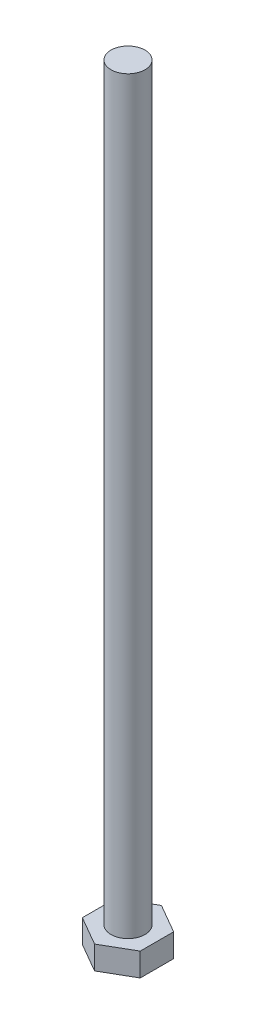
ISO-10303-21;
HEADER;
FILE_DESCRIPTION(('STEP AP214'),'2;1');
FILE_NAME('part.step','',(''),(''),'','','');
FILE_SCHEMA(('AUTOMOTIVE_DESIGN { 1 0 10303 214 1 1 1 1 }'));
ENDSEC;
DATA;
#1=APPLICATION_CONTEXT('core data for automotive mechanical design processes');
#2=APPLICATION_PROTOCOL_DEFINITION('international standard','automotive_design',2000,#1);
#3=PRODUCT_CONTEXT('',#1,'mechanical');
#4=PRODUCT('Part','Part','',(#3));
#5=PRODUCT_RELATED_PRODUCT_CATEGORY('part','',(#4));
#6=PRODUCT_DEFINITION_FORMATION('','',#4);
#7=PRODUCT_DEFINITION_CONTEXT('part definition',#1,'design');
#8=PRODUCT_DEFINITION('design','',#6,#7);
#9=PRODUCT_DEFINITION_SHAPE('','',#8);
#10=(LENGTH_UNIT() NAMED_UNIT(*) SI_UNIT(.MILLI.,.METRE.));
#11=(NAMED_UNIT(*) PLANE_ANGLE_UNIT() SI_UNIT($,.RADIAN.));
#12=(NAMED_UNIT(*) SI_UNIT($,.STERADIAN.) SOLID_ANGLE_UNIT());
#13=UNCERTAINTY_MEASURE_WITH_UNIT(LENGTH_MEASURE(1.E-05),#10,'distance_accuracy_value','');
#14=(GEOMETRIC_REPRESENTATION_CONTEXT(3) GLOBAL_UNCERTAINTY_ASSIGNED_CONTEXT((#13)) GLOBAL_UNIT_ASSIGNED_CONTEXT((#10,
#11,#12)) REPRESENTATION_CONTEXT('',''));
#15=CARTESIAN_POINT('',(0.,0.,0.));
#16=DIRECTION('',(0.,0.,1.));
#17=DIRECTION('',(1.,0.,0.));
#18=AXIS2_PLACEMENT_3D('',#15,#16,#17);
#19=CARTESIAN_POINT('',(0.,8.,0.));
#20=DIRECTION('',(0.,1.,0.));
#21=DIRECTION('',(0.,0.,1.));
#22=AXIS2_PLACEMENT_3D('',#19,#20,#21);
#23=PLANE('',#22);
#24=DIRECTION('',(0.866025403784439,0.,-0.5));
#25=VECTOR('',#24,1.);
#26=CARTESIAN_POINT('',(0.,8.,9.81495457622364));
#27=LINE('',#26,#25);
#28=CARTESIAN_POINT('',(0.,8.,9.81495457622364));
#29=VERTEX_POINT('',#28);
#30=CARTESIAN_POINT('',(8.5,8.,4.90747728811182));
#31=VERTEX_POINT('',#30);
#32=EDGE_CURVE('E118',#29,#31,#27,.T.);
#33=ORIENTED_EDGE('',*,*,#32,.T.);
#34=DIRECTION('',(0.,0.,-1.));
#35=VECTOR('',#34,1.);
#36=CARTESIAN_POINT('',(8.5,8.,4.90747728811182));
#37=LINE('',#36,#35);
#38=CARTESIAN_POINT('',(8.5,8.,-4.90747728811182));
#39=VERTEX_POINT('',#38);
#40=EDGE_CURVE('E107',#31,#39,#37,.T.);
#41=ORIENTED_EDGE('',*,*,#40,.T.);
#42=DIRECTION('',(-0.866025403784439,0.,-0.5));
#43=VECTOR('',#42,1.);
#44=CARTESIAN_POINT('',(8.5,8.,-4.90747728811182));
#45=LINE('',#44,#43);
#46=CARTESIAN_POINT('',(0.,8.,-9.81495457622364));
#47=VERTEX_POINT('',#46);
#48=EDGE_CURVE('E117',#39,#47,#45,.T.);
#49=ORIENTED_EDGE('',*,*,#48,.T.);
#50=DIRECTION('',(-0.866025403784439,0.,0.5));
#51=VECTOR('',#50,1.);
#52=CARTESIAN_POINT('',(0.,8.,-9.81495457622364));
#53=LINE('',#52,#51);
#54=CARTESIAN_POINT('',(-8.5,8.,-4.90747728811182));
#55=VERTEX_POINT('',#54);
#56=EDGE_CURVE('E186',#47,#55,#53,.T.);
#57=ORIENTED_EDGE('',*,*,#56,.T.);
#58=DIRECTION('',(0.,0.,1.));
#59=VECTOR('',#58,1.);
#60=CARTESIAN_POINT('',(-8.5,8.,-4.90747728811182));
#61=LINE('',#60,#59);
#62=CARTESIAN_POINT('',(-8.5,8.,4.90747728811182));
#63=VERTEX_POINT('',#62);
#64=EDGE_CURVE('E188',#55,#63,#61,.T.);
#65=ORIENTED_EDGE('',*,*,#64,.T.);
#66=DIRECTION('',(0.866025403784438,0.,0.5));
#67=VECTOR('',#66,1.);
#68=CARTESIAN_POINT('',(-8.5,8.,4.90747728811182));
#69=LINE('',#68,#67);
#70=EDGE_CURVE('E123',#63,#29,#69,.T.);
#71=ORIENTED_EDGE('',*,*,#70,.T.);
#72=EDGE_LOOP('',(#33,#41,#49,#57,#65,#71));
#73=FACE_BOUND('',#72,.T.);
#74=CARTESIAN_POINT('',(0.,8.,0.));
#75=DIRECTION('',(0.,1.,0.));
#76=DIRECTION('',(0.,0.,1.));
#77=AXIS2_PLACEMENT_3D('',#74,#75,#76);
#78=CIRCLE('',#77,5.);
#79=CARTESIAN_POINT('',(0.,8.,5.));
#80=VERTEX_POINT('',#79);
#81=EDGE_CURVE('E174',#80,#80,#78,.T.);
#82=ORIENTED_EDGE('',*,*,#81,.F.);
#83=EDGE_LOOP('',(#82));
#84=FACE_BOUND('',#83,.T.);
#85=ADVANCED_FACE('F34',(#73,#84),#23,.T.);
#86=CARTESIAN_POINT('',(0.,8.,9.81495457622364));
#87=DIRECTION('',(-0.5,0.,-0.866025403784439));
#88=DIRECTION('',(-0.866025403784439,0.,0.5));
#89=AXIS2_PLACEMENT_3D('',#86,#87,#88);
#90=PLANE('',#89);
#91=DIRECTION('',(0.,-1.,0.));
#92=VECTOR('',#91,1.);
#93=CARTESIAN_POINT('',(0.,8.,9.81495457622364));
#94=LINE('',#93,#92);
#95=CARTESIAN_POINT('',(0.,1.15470053837927,9.81495457622364));
#96=VERTEX_POINT('',#95);
#97=EDGE_CURVE('E191',#29,#96,#94,.T.);
#98=ORIENTED_EDGE('',*,*,#97,.T.);
#99=DIRECTION('',(0.866025403784439,0.,-0.5));
#100=VECTOR('',#99,1.);
#101=CARTESIAN_POINT('',(0.,1.15470053837927,9.81495457622364));
#102=LINE('',#101,#100);
#103=CARTESIAN_POINT('',(8.5,1.15470053837927,4.90747728811182));
#104=VERTEX_POINT('',#103);
#105=EDGE_CURVE('E131',#96,#104,#102,.T.);
#106=ORIENTED_EDGE('',*,*,#105,.T.);
#107=DIRECTION('',(0.,-1.,0.));
#108=VECTOR('',#107,1.);
#109=CARTESIAN_POINT('',(8.5,8.,4.90747728811182));
#110=LINE('',#109,#108);
#111=EDGE_CURVE('E111',#31,#104,#110,.T.);
#112=ORIENTED_EDGE('',*,*,#111,.F.);
#113=ORIENTED_EDGE('',*,*,#32,.F.);
#114=EDGE_LOOP('',(#98,#106,#112,#113));
#115=FACE_BOUND('',#114,.T.);
#116=ADVANCED_FACE('F129',(#115),#90,.F.);
#117=CARTESIAN_POINT('',(8.5,8.,4.90747728811182));
#118=DIRECTION('',(-1.,0.,0.));
#119=DIRECTION('',(0.,0.,1.));
#120=AXIS2_PLACEMENT_3D('',#117,#118,#119);
#121=PLANE('',#120);
#122=ORIENTED_EDGE('',*,*,#111,.T.);
#123=DIRECTION('',(0.,0.,-1.));
#124=VECTOR('',#123,1.);
#125=CARTESIAN_POINT('',(8.5,1.15470053837927,4.90747728811182));
#126=LINE('',#125,#124);
#127=CARTESIAN_POINT('',(8.5,1.15470053837927,-4.90747728811182));
#128=VERTEX_POINT('',#127);
#129=EDGE_CURVE('E153',#104,#128,#126,.T.);
#130=ORIENTED_EDGE('',*,*,#129,.T.);
#131=DIRECTION('',(0.,-1.,0.));
#132=VECTOR('',#131,1.);
#133=CARTESIAN_POINT('',(8.5,8.,-4.90747728811182));
#134=LINE('',#133,#132);
#135=EDGE_CURVE('E114',#39,#128,#134,.T.);
#136=ORIENTED_EDGE('',*,*,#135,.F.);
#137=ORIENTED_EDGE('',*,*,#40,.F.);
#138=EDGE_LOOP('',(#122,#130,#136,#137));
#139=FACE_BOUND('',#138,.T.);
#140=ADVANCED_FACE('F109',(#139),#121,.F.);
#141=CARTESIAN_POINT('',(8.5,8.,-4.90747728811182));
#142=DIRECTION('',(-0.5,0.,0.866025403784439));
#143=DIRECTION('',(0.866025403784439,0.,0.5));
#144=AXIS2_PLACEMENT_3D('',#141,#142,#143);
#145=PLANE('',#144);
#146=ORIENTED_EDGE('',*,*,#135,.T.);
#147=DIRECTION('',(-0.866025403784439,0.,-0.5));
#148=VECTOR('',#147,1.);
#149=CARTESIAN_POINT('',(8.5,1.15470053837927,-4.90747728811182));
#150=LINE('',#149,#148);
#151=CARTESIAN_POINT('',(0.,1.15470053837927,-9.81495457622364));
#152=VERTEX_POINT('',#151);
#153=EDGE_CURVE('E132',#128,#152,#150,.T.);
#154=ORIENTED_EDGE('',*,*,#153,.T.);
#155=DIRECTION('',(0.,-1.,0.));
#156=VECTOR('',#155,1.);
#157=CARTESIAN_POINT('',(0.,8.,-9.81495457622364));
#158=LINE('',#157,#156);
#159=EDGE_CURVE('E137',#47,#152,#158,.T.);
#160=ORIENTED_EDGE('',*,*,#159,.F.);
#161=ORIENTED_EDGE('',*,*,#48,.F.);
#162=EDGE_LOOP('',(#146,#154,#160,#161));
#163=FACE_BOUND('',#162,.T.);
#164=ADVANCED_FACE('F200',(#163),#145,.F.);
#165=CARTESIAN_POINT('',(0.,8.,-9.81495457622364));
#166=DIRECTION('',(0.5,0.,0.866025403784439));
#167=DIRECTION('',(0.866025403784439,0.,-0.5));
#168=AXIS2_PLACEMENT_3D('',#165,#166,#167);
#169=PLANE('',#168);
#170=ORIENTED_EDGE('',*,*,#159,.T.);
#171=DIRECTION('',(-0.866025403784439,0.,0.5));
#172=VECTOR('',#171,1.);
#173=CARTESIAN_POINT('',(0.,1.15470053837927,-9.81495457622364));
#174=LINE('',#173,#172);
#175=CARTESIAN_POINT('',(-8.5,1.15470053837927,-4.90747728811182));
#176=VERTEX_POINT('',#175);
#177=EDGE_CURVE('E11',#152,#176,#174,.T.);
#178=ORIENTED_EDGE('',*,*,#177,.T.);
#179=DIRECTION('',(0.,-1.,0.));
#180=VECTOR('',#179,1.);
#181=CARTESIAN_POINT('',(-8.5,8.,-4.90747728811182));
#182=LINE('',#181,#180);
#183=EDGE_CURVE('E195',#55,#176,#182,.T.);
#184=ORIENTED_EDGE('',*,*,#183,.F.);
#185=ORIENTED_EDGE('',*,*,#56,.F.);
#186=EDGE_LOOP('',(#170,#178,#184,#185));
#187=FACE_BOUND('',#186,.T.);
#188=ADVANCED_FACE('F198',(#187),#169,.F.);
#189=CARTESIAN_POINT('',(-8.5,8.,-4.90747728811182));
#190=DIRECTION('',(1.,0.,0.));
#191=DIRECTION('',(0.,0.,-1.));
#192=AXIS2_PLACEMENT_3D('',#189,#190,#191);
#193=PLANE('',#192);
#194=ORIENTED_EDGE('',*,*,#183,.T.);
#195=DIRECTION('',(0.,0.,1.));
#196=VECTOR('',#195,1.);
#197=CARTESIAN_POINT('',(-8.5,1.15470053837927,-4.90747728811182));
#198=LINE('',#197,#196);
#199=CARTESIAN_POINT('',(-8.5,1.15470053837927,4.90747728811182));
#200=VERTEX_POINT('',#199);
#201=EDGE_CURVE('E43',#176,#200,#198,.T.);
#202=ORIENTED_EDGE('',*,*,#201,.T.);
#203=DIRECTION('',(0.,-1.,0.));
#204=VECTOR('',#203,1.);
#205=CARTESIAN_POINT('',(-8.5,8.,4.90747728811182));
#206=LINE('',#205,#204);
#207=EDGE_CURVE('E193',#63,#200,#206,.T.);
#208=ORIENTED_EDGE('',*,*,#207,.F.);
#209=ORIENTED_EDGE('',*,*,#64,.F.);
#210=EDGE_LOOP('',(#194,#202,#208,#209));
#211=FACE_BOUND('',#210,.T.);
#212=ADVANCED_FACE('F221',(#211),#193,.F.);
#213=CARTESIAN_POINT('',(-8.5,8.,4.90747728811182));
#214=DIRECTION('',(0.5,0.,-0.866025403784438));
#215=DIRECTION('',(-0.866025403784438,0.,-0.5));
#216=AXIS2_PLACEMENT_3D('',#213,#214,#215);
#217=PLANE('',#216);
#218=ORIENTED_EDGE('',*,*,#207,.T.);
#219=DIRECTION('',(0.866025403784438,0.,0.5));
#220=VECTOR('',#219,1.);
#221=CARTESIAN_POINT('',(-8.5,1.15470053837927,4.90747728811182));
#222=LINE('',#221,#220);
#223=EDGE_CURVE('E156',#200,#96,#222,.T.);
#224=ORIENTED_EDGE('',*,*,#223,.T.);
#225=ORIENTED_EDGE('',*,*,#97,.F.);
#226=ORIENTED_EDGE('',*,*,#70,.F.);
#227=EDGE_LOOP('',(#218,#224,#225,#226));
#228=FACE_BOUND('',#227,.T.);
#229=ADVANCED_FACE('F219',(#228),#217,.F.);
#230=CARTESIAN_POINT('',(0.,0.,0.));
#231=DIRECTION('',(0.,1.,0.));
#232=DIRECTION('',(0.,0.,1.));
#233=AXIS2_PLACEMENT_3D('',#230,#231,#232);
#234=PLANE('',#233);
#235=DIRECTION('',(0.866025403784439,0.,-0.5));
#236=VECTOR('',#235,1.);
#237=CARTESIAN_POINT('',(-3.24999999999998,0.,-5.62916512459883));
#238=LINE('',#237,#236);
#239=CARTESIAN_POINT('',(-6.49999999999997,0.,-3.75277674973256));
#240=VERTEX_POINT('',#239);
#241=CARTESIAN_POINT('',(0.,0.,-7.5055534994651));
#242=VERTEX_POINT('',#241);
#243=EDGE_CURVE('E135',#240,#242,#238,.T.);
#244=ORIENTED_EDGE('',*,*,#243,.T.);
#245=DIRECTION('',(0.866025403784439,0.,0.5));
#246=VECTOR('',#245,1.);
#247=CARTESIAN_POINT('',(3.24999999999999,0.,-5.62916512459883));
#248=LINE('',#247,#246);
#249=CARTESIAN_POINT('',(6.49999999999997,0.,-3.75277674973255));
#250=VERTEX_POINT('',#249);
#251=EDGE_CURVE('E150',#242,#250,#248,.T.);
#252=ORIENTED_EDGE('',*,*,#251,.T.);
#253=DIRECTION('',(0.,0.,1.));
#254=VECTOR('',#253,1.);
#255=CARTESIAN_POINT('',(6.49999999999997,0.,0.));
#256=LINE('',#255,#254);
#257=CARTESIAN_POINT('',(6.49999999999997,0.,3.75277674973255));
#258=VERTEX_POINT('',#257);
#259=EDGE_CURVE('E148',#250,#258,#256,.T.);
#260=ORIENTED_EDGE('',*,*,#259,.T.);
#261=DIRECTION('',(-0.866025403784439,0.,0.5));
#262=VECTOR('',#261,1.);
#263=CARTESIAN_POINT('',(3.24999999999998,0.,5.62916512459883));
#264=LINE('',#263,#262);
#265=CARTESIAN_POINT('',(0.,0.,7.5055534994651));
#266=VERTEX_POINT('',#265);
#267=EDGE_CURVE('E146',#258,#266,#264,.T.);
#268=ORIENTED_EDGE('',*,*,#267,.T.);
#269=DIRECTION('',(-0.866025403784439,0.,-0.5));
#270=VECTOR('',#269,1.);
#271=CARTESIAN_POINT('',(-3.24999999999999,0.,5.62916512459882));
#272=LINE('',#271,#270);
#273=CARTESIAN_POINT('',(-6.49999999999997,0.,3.75277674973255));
#274=VERTEX_POINT('',#273);
#275=EDGE_CURVE('E144',#266,#274,#272,.T.);
#276=ORIENTED_EDGE('',*,*,#275,.T.);
#277=DIRECTION('',(0.,0.,-1.));
#278=VECTOR('',#277,1.);
#279=CARTESIAN_POINT('',(-6.49999999999997,0.,0.));
#280=LINE('',#279,#278);
#281=EDGE_CURVE('E142',#274,#240,#280,.T.);
#282=ORIENTED_EDGE('',*,*,#281,.T.);
#283=EDGE_LOOP('',(#244,#252,#260,#268,#276,#282));
#284=FACE_BOUND('',#283,.T.);
#285=ADVANCED_FACE('F214',(#284),#234,.F.);
#286=CARTESIAN_POINT('',(0.,228.,0.));
#287=DIRECTION('',(0.,-1.,0.));
#288=DIRECTION('',(0.,0.,-1.));
#289=AXIS2_PLACEMENT_3D('',#286,#287,#288);
#290=CYLINDRICAL_SURFACE('',#289,5.);
#291=CARTESIAN_POINT('',(0.,228.,0.));
#292=DIRECTION('',(0.,1.,0.));
#293=DIRECTION('',(0.,0.,1.));
#294=AXIS2_PLACEMENT_3D('',#291,#292,#293);
#295=CIRCLE('',#294,5.);
#296=CARTESIAN_POINT('',(0.,228.,5.));
#297=VERTEX_POINT('',#296);
#298=EDGE_CURVE('E127',#297,#297,#295,.T.);
#299=ORIENTED_EDGE('',*,*,#298,.F.);
#300=EDGE_LOOP('',(#299));
#301=FACE_BOUND('',#300,.T.);
#302=ORIENTED_EDGE('',*,*,#81,.T.);
#303=EDGE_LOOP('',(#302));
#304=FACE_BOUND('',#303,.T.);
#305=ADVANCED_FACE('F238',(#301,#304),#290,.T.);
#306=CARTESIAN_POINT('',(0.,228.,0.));
#307=DIRECTION('',(0.,1.,0.));
#308=DIRECTION('',(0.,0.,1.));
#309=AXIS2_PLACEMENT_3D('',#306,#307,#308);
#310=PLANE('',#309);
#311=ORIENTED_EDGE('',*,*,#298,.T.);
#312=EDGE_LOOP('',(#311));
#313=FACE_BOUND('',#312,.T.);
#314=ADVANCED_FACE('F244',(#313),#310,.T.);
#315=CARTESIAN_POINT('',(-8.5,1.15470053837927,4.90747728811182));
#316=DIRECTION('',(0.25,0.866025403784439,-0.433012701892218));
#317=DIRECTION('',(0.866025403784438,0.,0.5));
#318=AXIS2_PLACEMENT_3D('',#315,#316,#317);
#319=PLANE('',#318);
#320=DIRECTION('',(-0.774596669241484,0.447213595499957,0.447213595499958));
#321=VECTOR('',#320,1.);
#322=CARTESIAN_POINT('',(-5.1,-0.808290376865458,2.94448637286709));
#323=LINE('',#322,#321);
#324=EDGE_CURVE('E168',#274,#200,#323,.T.);
#325=ORIENTED_EDGE('',*,*,#324,.F.);
#326=ORIENTED_EDGE('',*,*,#275,.F.);
#327=DIRECTION('',(0.,0.447213595499957,0.894427190999916));
#328=VECTOR('',#327,1.);
#329=CARTESIAN_POINT('',(0.,-0.808290376865458,5.88897274573418));
#330=LINE('',#329,#328);
#331=EDGE_CURVE('E38',#96,#266,#330,.F.);
#332=ORIENTED_EDGE('',*,*,#331,.F.);
#333=ORIENTED_EDGE('',*,*,#223,.F.);
#334=EDGE_LOOP('',(#325,#326,#332,#333));
#335=FACE_BOUND('',#334,.T.);
#336=ADVANCED_FACE('F36',(#335),#319,.F.);
#337=CARTESIAN_POINT('',(0.,1.15470053837927,9.81495457622364));
#338=DIRECTION('',(-0.249999999999999,0.866025403784439,-0.433012701892219));
#339=DIRECTION('',(0.866025403784439,0.,-0.5));
#340=AXIS2_PLACEMENT_3D('',#337,#338,#339);
#341=PLANE('',#340);
#342=ORIENTED_EDGE('',*,*,#331,.T.);
#343=ORIENTED_EDGE('',*,*,#267,.F.);
#344=DIRECTION('',(0.774596669241484,0.447213595499957,0.447213595499958));
#345=VECTOR('',#344,1.);
#346=CARTESIAN_POINT('',(5.09999999999999,-0.808290376865459,2.94448637286709));
#347=LINE('',#346,#345);
#348=EDGE_CURVE('E166',#104,#258,#347,.F.);
#349=ORIENTED_EDGE('',*,*,#348,.F.);
#350=ORIENTED_EDGE('',*,*,#105,.F.);
#351=EDGE_LOOP('',(#342,#343,#349,#350));
#352=FACE_BOUND('',#351,.T.);
#353=ADVANCED_FACE('F254',(#352),#341,.F.);
#354=CARTESIAN_POINT('',(-8.5,1.15470053837927,-4.90747728811182));
#355=DIRECTION('',(0.499999999999999,0.866025403784439,0.));
#356=DIRECTION('',(0.,0.,1.));
#357=AXIS2_PLACEMENT_3D('',#354,#355,#356);
#358=PLANE('',#357);
#359=ORIENTED_EDGE('',*,*,#324,.T.);
#360=ORIENTED_EDGE('',*,*,#201,.F.);
#361=DIRECTION('',(-0.774596669241484,0.447213595499957,-0.447213595499958));
#362=VECTOR('',#361,1.);
#363=CARTESIAN_POINT('',(-5.1,-0.80829037686546,-2.94448637286709));
#364=LINE('',#363,#362);
#365=EDGE_CURVE('E163',#240,#176,#364,.T.);
#366=ORIENTED_EDGE('',*,*,#365,.F.);
#367=ORIENTED_EDGE('',*,*,#281,.F.);
#368=EDGE_LOOP('',(#359,#360,#366,#367));
#369=FACE_BOUND('',#368,.T.);
#370=ADVANCED_FACE('F212',(#369),#358,.F.);
#371=CARTESIAN_POINT('',(8.5,1.15470053837927,4.90747728811182));
#372=DIRECTION('',(-0.499999999999999,0.866025403784439,0.));
#373=DIRECTION('',(0.,0.,-1.));
#374=AXIS2_PLACEMENT_3D('',#371,#372,#373);
#375=PLANE('',#374);
#376=ORIENTED_EDGE('',*,*,#348,.T.);
#377=ORIENTED_EDGE('',*,*,#259,.F.);
#378=DIRECTION('',(0.774596669241484,0.447213595499957,-0.447213595499958));
#379=VECTOR('',#378,1.);
#380=CARTESIAN_POINT('',(5.09999999999999,-0.808290376865461,-2.94448637286709));
#381=LINE('',#380,#379);
#382=EDGE_CURVE('E161',#128,#250,#381,.F.);
#383=ORIENTED_EDGE('',*,*,#382,.F.);
#384=ORIENTED_EDGE('',*,*,#129,.F.);
#385=EDGE_LOOP('',(#376,#377,#383,#384));
#386=FACE_BOUND('',#385,.T.);
#387=ADVANCED_FACE('F261',(#386),#375,.F.);
#388=CARTESIAN_POINT('',(0.,1.15470053837927,-9.81495457622364));
#389=DIRECTION('',(0.249999999999999,0.866025403784439,0.433012701892219));
#390=DIRECTION('',(-0.866025403784439,0.,0.5));
#391=AXIS2_PLACEMENT_3D('',#388,#389,#390);
#392=PLANE('',#391);
#393=ORIENTED_EDGE('',*,*,#365,.T.);
#394=ORIENTED_EDGE('',*,*,#177,.F.);
#395=DIRECTION('',(0.,-0.447213595499957,0.894427190999916));
#396=VECTOR('',#395,1.);
#397=CARTESIAN_POINT('',(0.,1.15470053837927,-9.81495457622364));
#398=LINE('',#397,#396);
#399=EDGE_CURVE('E159',#242,#152,#398,.F.);
#400=ORIENTED_EDGE('',*,*,#399,.F.);
#401=ORIENTED_EDGE('',*,*,#243,.F.);
#402=EDGE_LOOP('',(#393,#394,#400,#401));
#403=FACE_BOUND('',#402,.T.);
#404=ADVANCED_FACE('F210',(#403),#392,.F.);
#405=CARTESIAN_POINT('',(8.5,1.15470053837927,-4.90747728811182));
#406=DIRECTION('',(-0.249999999999999,0.866025403784439,0.433012701892218));
#407=DIRECTION('',(-0.866025403784439,0.,-0.5));
#408=AXIS2_PLACEMENT_3D('',#405,#406,#407);
#409=PLANE('',#408);
#410=ORIENTED_EDGE('',*,*,#382,.T.);
#411=ORIENTED_EDGE('',*,*,#251,.F.);
#412=ORIENTED_EDGE('',*,*,#399,.T.);
#413=ORIENTED_EDGE('',*,*,#153,.F.);
#414=EDGE_LOOP('',(#410,#411,#412,#413));
#415=FACE_BOUND('',#414,.T.);
#416=ADVANCED_FACE('F204',(#415),#409,.F.);
#417=CLOSED_SHELL('',(#85,#116,#140,#164,#188,#212,#229,#285,#305,#314,#336,#353,#370,#387,#404,#416));
#418=MANIFOLD_SOLID_BREP('B2',#417);
#419=ADVANCED_BREP_SHAPE_REPRESENTATION('',(#18,#418),#14);
#420=SHAPE_DEFINITION_REPRESENTATION(#9,#419);
ENDSEC;
END-ISO-10303-21;
